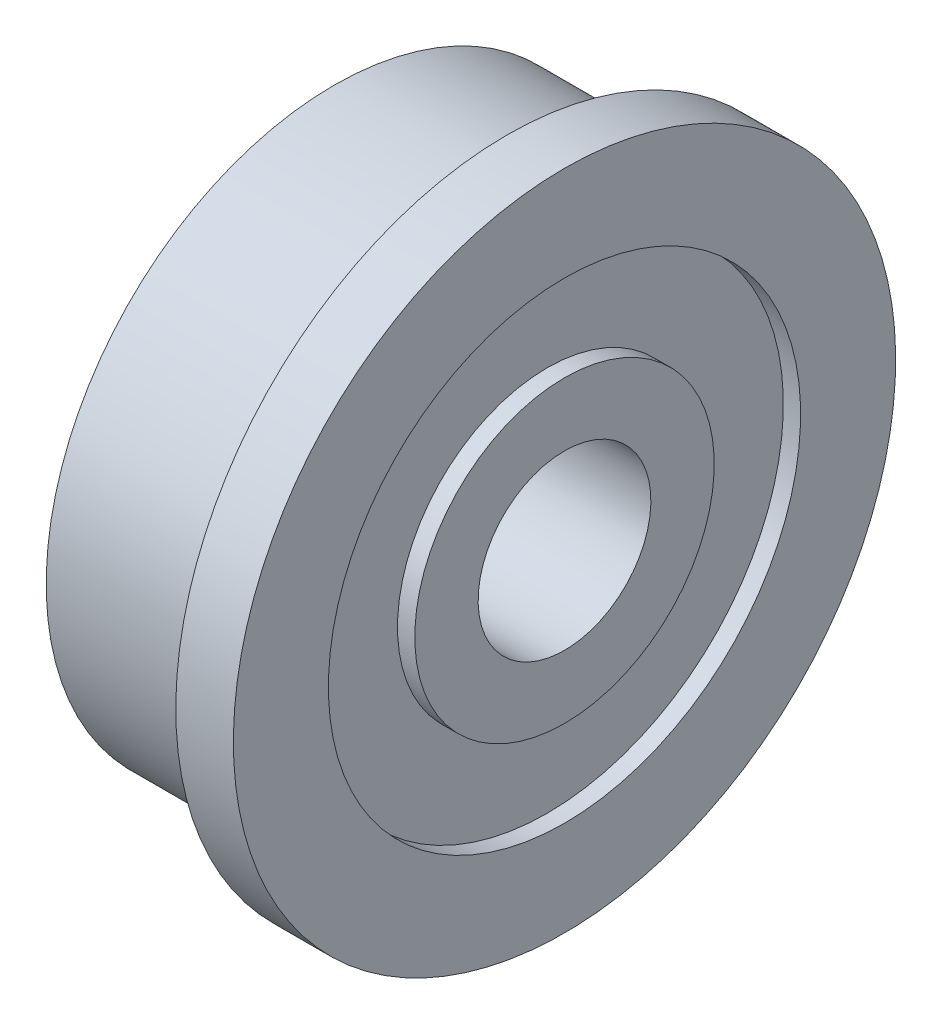
ISO-10303-21;
HEADER;
FILE_DESCRIPTION(('STEP AP214'),'2;1');
FILE_NAME('part.step','',(''),(''),'','','');
FILE_SCHEMA(('AUTOMOTIVE_DESIGN { 1 0 10303 214 1 1 1 1 }'));
ENDSEC;
DATA;
#1=APPLICATION_CONTEXT('core data for automotive mechanical design processes');
#2=APPLICATION_PROTOCOL_DEFINITION('international standard','automotive_design',2000,#1);
#3=PRODUCT_CONTEXT('',#1,'mechanical');
#4=PRODUCT('Part','Part','',(#3));
#5=PRODUCT_RELATED_PRODUCT_CATEGORY('part','',(#4));
#6=PRODUCT_DEFINITION_FORMATION('','',#4);
#7=PRODUCT_DEFINITION_CONTEXT('part definition',#1,'design');
#8=PRODUCT_DEFINITION('design','',#6,#7);
#9=PRODUCT_DEFINITION_SHAPE('','',#8);
#10=(LENGTH_UNIT() NAMED_UNIT(*) SI_UNIT(.MILLI.,.METRE.));
#11=(NAMED_UNIT(*) PLANE_ANGLE_UNIT() SI_UNIT($,.RADIAN.));
#12=(NAMED_UNIT(*) SI_UNIT($,.STERADIAN.) SOLID_ANGLE_UNIT());
#13=UNCERTAINTY_MEASURE_WITH_UNIT(LENGTH_MEASURE(1.E-05),#10,'distance_accuracy_value','');
#14=(GEOMETRIC_REPRESENTATION_CONTEXT(3) GLOBAL_UNCERTAINTY_ASSIGNED_CONTEXT((#13)) GLOBAL_UNIT_ASSIGNED_CONTEXT((#10,
#11,#12)) REPRESENTATION_CONTEXT('',''));
#15=CARTESIAN_POINT('',(0.,0.,0.));
#16=DIRECTION('',(0.,0.,1.));
#17=DIRECTION('',(1.,0.,0.));
#18=AXIS2_PLACEMENT_3D('',#15,#16,#17);
#19=CARTESIAN_POINT('',(-2.,1.5,0.));
#20=DIRECTION('',(-1.,0.,0.));
#21=DIRECTION('',(0.,-1.,0.));
#22=AXIS2_PLACEMENT_3D('',#19,#20,#21);
#23=PLANE('',#22);
#24=CARTESIAN_POINT('',(-2.,0.,0.));
#25=DIRECTION('',(1.,0.,0.));
#26=DIRECTION('',(0.,1.,0.));
#27=AXIS2_PLACEMENT_3D('',#24,#25,#26);
#28=CIRCLE('',#27,1.5);
#29=CARTESIAN_POINT('',(-2.,1.5,0.));
#30=VERTEX_POINT('',#29);
#31=EDGE_CURVE('E82',#30,#30,#28,.T.);
#32=ORIENTED_EDGE('',*,*,#31,.T.);
#33=EDGE_LOOP('',(#32));
#34=FACE_BOUND('',#33,.T.);
#35=CARTESIAN_POINT('',(-2.,0.,0.));
#36=DIRECTION('',(1.,0.,0.));
#37=DIRECTION('',(0.,1.,0.));
#38=AXIS2_PLACEMENT_3D('',#35,#36,#37);
#39=CIRCLE('',#38,2.6);
#40=CARTESIAN_POINT('',(-2.,2.6,0.));
#41=VERTEX_POINT('',#40);
#42=EDGE_CURVE('E10',#41,#41,#39,.T.);
#43=ORIENTED_EDGE('',*,*,#42,.F.);
#44=EDGE_LOOP('',(#43));
#45=FACE_BOUND('',#44,.T.);
#46=ADVANCED_FACE('F34',(#34,#45),#23,.T.);
#47=CARTESIAN_POINT('',(0.,0.,0.));
#48=DIRECTION('',(1.,0.,0.));
#49=DIRECTION('',(0.,1.,0.));
#50=AXIS2_PLACEMENT_3D('',#47,#48,#49);
#51=CYLINDRICAL_SURFACE('',#50,2.6);
#52=ORIENTED_EDGE('',*,*,#42,.T.);
#53=EDGE_LOOP('',(#52));
#54=FACE_BOUND('',#53,.T.);
#55=CARTESIAN_POINT('',(-1.7,0.,0.));
#56=DIRECTION('',(1.,0.,0.));
#57=DIRECTION('',(0.,1.,0.));
#58=AXIS2_PLACEMENT_3D('',#55,#56,#57);
#59=CIRCLE('',#58,2.6);
#60=CARTESIAN_POINT('',(-1.7,2.6,0.));
#61=VERTEX_POINT('',#60);
#62=EDGE_CURVE('E40',#61,#61,#59,.T.);
#63=ORIENTED_EDGE('',*,*,#62,.F.);
#64=EDGE_LOOP('',(#63));
#65=FACE_BOUND('',#64,.T.);
#66=ADVANCED_FACE('F102',(#54,#65),#51,.T.);
#67=CARTESIAN_POINT('',(-1.7,2.6,0.));
#68=DIRECTION('',(-1.,0.,0.));
#69=DIRECTION('',(0.,-1.,0.));
#70=AXIS2_PLACEMENT_3D('',#67,#68,#69);
#71=PLANE('',#70);
#72=ORIENTED_EDGE('',*,*,#62,.T.);
#73=EDGE_LOOP('',(#72));
#74=FACE_BOUND('',#73,.T.);
#75=CARTESIAN_POINT('',(-1.7,0.,0.));
#76=DIRECTION('',(1.,0.,0.));
#77=DIRECTION('',(0.,1.,0.));
#78=AXIS2_PLACEMENT_3D('',#75,#76,#77);
#79=CIRCLE('',#78,4.1);
#80=CARTESIAN_POINT('',(-1.7,4.1,0.));
#81=VERTEX_POINT('',#80);
#82=EDGE_CURVE('E44',#81,#81,#79,.T.);
#83=ORIENTED_EDGE('',*,*,#82,.F.);
#84=EDGE_LOOP('',(#83));
#85=FACE_BOUND('',#84,.T.);
#86=ADVANCED_FACE('F106',(#74,#85),#71,.T.);
#87=CARTESIAN_POINT('',(0.,0.,0.));
#88=DIRECTION('',(1.,0.,0.));
#89=DIRECTION('',(0.,1.,0.));
#90=AXIS2_PLACEMENT_3D('',#87,#88,#89);
#91=CYLINDRICAL_SURFACE('',#90,4.1);
#92=ORIENTED_EDGE('',*,*,#82,.T.);
#93=EDGE_LOOP('',(#92));
#94=FACE_BOUND('',#93,.T.);
#95=CARTESIAN_POINT('',(-2.,0.,0.));
#96=DIRECTION('',(1.,0.,0.));
#97=DIRECTION('',(0.,1.,0.));
#98=AXIS2_PLACEMENT_3D('',#95,#96,#97);
#99=CIRCLE('',#98,4.1);
#100=CARTESIAN_POINT('',(-2.,4.1,0.));
#101=VERTEX_POINT('',#100);
#102=EDGE_CURVE('E48',#101,#101,#99,.T.);
#103=ORIENTED_EDGE('',*,*,#102,.F.);
#104=EDGE_LOOP('',(#103));
#105=FACE_BOUND('',#104,.T.);
#106=ADVANCED_FACE('F110',(#94,#105),#91,.F.);
#107=CARTESIAN_POINT('',(-2.,4.1,0.));
#108=DIRECTION('',(-1.,0.,0.));
#109=DIRECTION('',(0.,-1.,0.));
#110=AXIS2_PLACEMENT_3D('',#107,#108,#109);
#111=PLANE('',#110);
#112=ORIENTED_EDGE('',*,*,#102,.T.);
#113=EDGE_LOOP('',(#112));
#114=FACE_BOUND('',#113,.T.);
#115=CARTESIAN_POINT('',(-2.,0.,0.));
#116=DIRECTION('',(1.,0.,0.));
#117=DIRECTION('',(0.,1.,0.));
#118=AXIS2_PLACEMENT_3D('',#115,#116,#117);
#119=CIRCLE('',#118,5.);
#120=CARTESIAN_POINT('',(-2.,5.,0.));
#121=VERTEX_POINT('',#120);
#122=EDGE_CURVE('E54',#121,#121,#119,.T.);
#123=ORIENTED_EDGE('',*,*,#122,.F.);
#124=EDGE_LOOP('',(#123));
#125=FACE_BOUND('',#124,.T.);
#126=ADVANCED_FACE('F116',(#114,#125),#111,.T.);
#127=CARTESIAN_POINT('',(0.,0.,0.));
#128=DIRECTION('',(1.,0.,0.));
#129=DIRECTION('',(0.,1.,0.));
#130=AXIS2_PLACEMENT_3D('',#127,#128,#129);
#131=CYLINDRICAL_SURFACE('',#130,5.);
#132=ORIENTED_EDGE('',*,*,#122,.T.);
#133=EDGE_LOOP('',(#132));
#134=FACE_BOUND('',#133,.T.);
#135=CARTESIAN_POINT('',(1.,0.,0.));
#136=DIRECTION('',(1.,0.,0.));
#137=DIRECTION('',(0.,1.,0.));
#138=AXIS2_PLACEMENT_3D('',#135,#136,#137);
#139=CIRCLE('',#138,5.);
#140=CARTESIAN_POINT('',(1.,5.,0.));
#141=VERTEX_POINT('',#140);
#142=EDGE_CURVE('E57',#141,#141,#139,.T.);
#143=ORIENTED_EDGE('',*,*,#142,.F.);
#144=EDGE_LOOP('',(#143));
#145=FACE_BOUND('',#144,.T.);
#146=ADVANCED_FACE('F120',(#134,#145),#131,.T.);
#147=CARTESIAN_POINT('',(1.,5.75,0.));
#148=DIRECTION('',(-1.,0.,0.));
#149=DIRECTION('',(0.,-1.,0.));
#150=AXIS2_PLACEMENT_3D('',#147,#148,#149);
#151=PLANE('',#150);
#152=ORIENTED_EDGE('',*,*,#142,.T.);
#153=EDGE_LOOP('',(#152));
#154=FACE_BOUND('',#153,.T.);
#155=CARTESIAN_POINT('',(1.,0.,0.));
#156=DIRECTION('',(1.,0.,0.));
#157=DIRECTION('',(0.,1.,0.));
#158=AXIS2_PLACEMENT_3D('',#155,#156,#157);
#159=CIRCLE('',#158,5.75);
#160=CARTESIAN_POINT('',(1.,5.75,0.));
#161=VERTEX_POINT('',#160);
#162=EDGE_CURVE('E60',#161,#161,#159,.T.);
#163=ORIENTED_EDGE('',*,*,#162,.F.);
#164=EDGE_LOOP('',(#163));
#165=FACE_BOUND('',#164,.T.);
#166=ADVANCED_FACE('F124',(#154,#165),#151,.T.);
#167=CARTESIAN_POINT('',(0.,0.,0.));
#168=DIRECTION('',(1.,0.,0.));
#169=DIRECTION('',(0.,1.,0.));
#170=AXIS2_PLACEMENT_3D('',#167,#168,#169);
#171=CYLINDRICAL_SURFACE('',#170,5.75);
#172=ORIENTED_EDGE('',*,*,#162,.T.);
#173=EDGE_LOOP('',(#172));
#174=FACE_BOUND('',#173,.T.);
#175=CARTESIAN_POINT('',(2.,0.,0.));
#176=DIRECTION('',(1.,0.,0.));
#177=DIRECTION('',(0.,1.,0.));
#178=AXIS2_PLACEMENT_3D('',#175,#176,#177);
#179=CIRCLE('',#178,5.75);
#180=CARTESIAN_POINT('',(2.,5.75,0.));
#181=VERTEX_POINT('',#180);
#182=EDGE_CURVE('E63',#181,#181,#179,.T.);
#183=ORIENTED_EDGE('',*,*,#182,.F.);
#184=EDGE_LOOP('',(#183));
#185=FACE_BOUND('',#184,.T.);
#186=ADVANCED_FACE('F128',(#174,#185),#171,.T.);
#187=CARTESIAN_POINT('',(2.,4.1,0.));
#188=DIRECTION('',(1.,0.,0.));
#189=DIRECTION('',(0.,1.,0.));
#190=AXIS2_PLACEMENT_3D('',#187,#188,#189);
#191=PLANE('',#190);
#192=ORIENTED_EDGE('',*,*,#182,.T.);
#193=EDGE_LOOP('',(#192));
#194=FACE_BOUND('',#193,.T.);
#195=CARTESIAN_POINT('',(2.,0.,0.));
#196=DIRECTION('',(1.,0.,0.));
#197=DIRECTION('',(0.,1.,0.));
#198=AXIS2_PLACEMENT_3D('',#195,#196,#197);
#199=CIRCLE('',#198,4.1);
#200=CARTESIAN_POINT('',(2.,4.1,0.));
#201=VERTEX_POINT('',#200);
#202=EDGE_CURVE('E66',#201,#201,#199,.T.);
#203=ORIENTED_EDGE('',*,*,#202,.F.);
#204=EDGE_LOOP('',(#203));
#205=FACE_BOUND('',#204,.T.);
#206=ADVANCED_FACE('F132',(#194,#205),#191,.T.);
#207=CARTESIAN_POINT('',(0.,0.,0.));
#208=DIRECTION('',(1.,0.,0.));
#209=DIRECTION('',(0.,1.,0.));
#210=AXIS2_PLACEMENT_3D('',#207,#208,#209);
#211=CYLINDRICAL_SURFACE('',#210,4.1);
#212=ORIENTED_EDGE('',*,*,#202,.T.);
#213=EDGE_LOOP('',(#212));
#214=FACE_BOUND('',#213,.T.);
#215=CARTESIAN_POINT('',(1.7,0.,0.));
#216=DIRECTION('',(1.,0.,0.));
#217=DIRECTION('',(0.,1.,0.));
#218=AXIS2_PLACEMENT_3D('',#215,#216,#217);
#219=CIRCLE('',#218,4.1);
#220=CARTESIAN_POINT('',(1.7,4.1,0.));
#221=VERTEX_POINT('',#220);
#222=EDGE_CURVE('E69',#221,#221,#219,.T.);
#223=ORIENTED_EDGE('',*,*,#222,.F.);
#224=EDGE_LOOP('',(#223));
#225=FACE_BOUND('',#224,.T.);
#226=ADVANCED_FACE('F136',(#214,#225),#211,.F.);
#227=CARTESIAN_POINT('',(1.7,2.6,0.));
#228=DIRECTION('',(1.,0.,0.));
#229=DIRECTION('',(0.,1.,0.));
#230=AXIS2_PLACEMENT_3D('',#227,#228,#229);
#231=PLANE('',#230);
#232=ORIENTED_EDGE('',*,*,#222,.T.);
#233=EDGE_LOOP('',(#232));
#234=FACE_BOUND('',#233,.T.);
#235=CARTESIAN_POINT('',(1.7,0.,0.));
#236=DIRECTION('',(1.,0.,0.));
#237=DIRECTION('',(0.,1.,0.));
#238=AXIS2_PLACEMENT_3D('',#235,#236,#237);
#239=CIRCLE('',#238,2.6);
#240=CARTESIAN_POINT('',(1.7,2.6,0.));
#241=VERTEX_POINT('',#240);
#242=EDGE_CURVE('E73',#241,#241,#239,.T.);
#243=ORIENTED_EDGE('',*,*,#242,.F.);
#244=EDGE_LOOP('',(#243));
#245=FACE_BOUND('',#244,.T.);
#246=ADVANCED_FACE('F140',(#234,#245),#231,.T.);
#247=CARTESIAN_POINT('',(0.,0.,0.));
#248=DIRECTION('',(1.,0.,0.));
#249=DIRECTION('',(0.,1.,0.));
#250=AXIS2_PLACEMENT_3D('',#247,#248,#249);
#251=CYLINDRICAL_SURFACE('',#250,2.6);
#252=ORIENTED_EDGE('',*,*,#242,.T.);
#253=EDGE_LOOP('',(#252));
#254=FACE_BOUND('',#253,.T.);
#255=CARTESIAN_POINT('',(2.,0.,0.));
#256=DIRECTION('',(1.,0.,0.));
#257=DIRECTION('',(0.,1.,0.));
#258=AXIS2_PLACEMENT_3D('',#255,#256,#257);
#259=CIRCLE('',#258,2.6);
#260=CARTESIAN_POINT('',(2.,2.6,0.));
#261=VERTEX_POINT('',#260);
#262=EDGE_CURVE('E76',#261,#261,#259,.T.);
#263=ORIENTED_EDGE('',*,*,#262,.F.);
#264=EDGE_LOOP('',(#263));
#265=FACE_BOUND('',#264,.T.);
#266=ADVANCED_FACE('F98',(#254,#265),#251,.T.);
#267=CARTESIAN_POINT('',(2.,1.5,0.));
#268=DIRECTION('',(1.,0.,0.));
#269=DIRECTION('',(0.,1.,0.));
#270=AXIS2_PLACEMENT_3D('',#267,#268,#269);
#271=PLANE('',#270);
#272=ORIENTED_EDGE('',*,*,#262,.T.);
#273=EDGE_LOOP('',(#272));
#274=FACE_BOUND('',#273,.T.);
#275=CARTESIAN_POINT('',(2.,0.,0.));
#276=DIRECTION('',(1.,0.,0.));
#277=DIRECTION('',(0.,1.,0.));
#278=AXIS2_PLACEMENT_3D('',#275,#276,#277);
#279=CIRCLE('',#278,1.5);
#280=CARTESIAN_POINT('',(2.,1.5,0.));
#281=VERTEX_POINT('',#280);
#282=EDGE_CURVE('E79',#281,#281,#279,.T.);
#283=ORIENTED_EDGE('',*,*,#282,.F.);
#284=EDGE_LOOP('',(#283));
#285=FACE_BOUND('',#284,.T.);
#286=ADVANCED_FACE('F92',(#274,#285),#271,.T.);
#287=CARTESIAN_POINT('',(0.,0.,0.));
#288=DIRECTION('',(1.,0.,0.));
#289=DIRECTION('',(0.,1.,0.));
#290=AXIS2_PLACEMENT_3D('',#287,#288,#289);
#291=CYLINDRICAL_SURFACE('',#290,1.5);
#292=ORIENTED_EDGE('',*,*,#282,.T.);
#293=EDGE_LOOP('',(#292));
#294=FACE_BOUND('',#293,.T.);
#295=ORIENTED_EDGE('',*,*,#31,.F.);
#296=EDGE_LOOP('',(#295));
#297=FACE_BOUND('',#296,.T.);
#298=ADVANCED_FACE('F90',(#294,#297),#291,.F.);
#299=CLOSED_SHELL('',(#46,#66,#86,#106,#126,#146,#166,#186,#206,#226,#246,#266,#286,#298));
#300=MANIFOLD_SOLID_BREP('B2',#299);
#301=ADVANCED_BREP_SHAPE_REPRESENTATION('',(#18,#300),#14);
#302=SHAPE_DEFINITION_REPRESENTATION(#9,#301);
ENDSEC;
END-ISO-10303-21;
